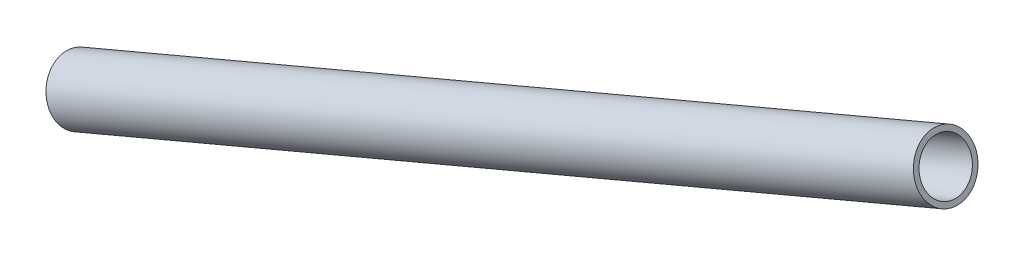
ISO-10303-21;
HEADER;
FILE_DESCRIPTION(('STEP AP214'),'2;1');
FILE_NAME('part.step','',(''),(''),'','','');
FILE_SCHEMA(('AUTOMOTIVE_DESIGN { 1 0 10303 214 1 1 1 1 }'));
ENDSEC;
DATA;
#1=APPLICATION_CONTEXT('core data for automotive mechanical design processes');
#2=APPLICATION_PROTOCOL_DEFINITION('international standard','automotive_design',2000,#1);
#3=PRODUCT_CONTEXT('',#1,'mechanical');
#4=PRODUCT('Part','Part','',(#3));
#5=PRODUCT_RELATED_PRODUCT_CATEGORY('part','',(#4));
#6=PRODUCT_DEFINITION_FORMATION('','',#4);
#7=PRODUCT_DEFINITION_CONTEXT('part definition',#1,'design');
#8=PRODUCT_DEFINITION('design','',#6,#7);
#9=PRODUCT_DEFINITION_SHAPE('','',#8);
#10=(LENGTH_UNIT() NAMED_UNIT(*) SI_UNIT(.MILLI.,.METRE.));
#11=(NAMED_UNIT(*) PLANE_ANGLE_UNIT() SI_UNIT($,.RADIAN.));
#12=(NAMED_UNIT(*) SI_UNIT($,.STERADIAN.) SOLID_ANGLE_UNIT());
#13=UNCERTAINTY_MEASURE_WITH_UNIT(LENGTH_MEASURE(1.E-05),#10,'distance_accuracy_value','');
#14=(GEOMETRIC_REPRESENTATION_CONTEXT(3) GLOBAL_UNCERTAINTY_ASSIGNED_CONTEXT((#13)) GLOBAL_UNIT_ASSIGNED_CONTEXT((#10,
#11,#12)) REPRESENTATION_CONTEXT('',''));
#15=CARTESIAN_POINT('',(0.,0.,0.));
#16=DIRECTION('',(0.,0.,1.));
#17=DIRECTION('',(1.,0.,0.));
#18=AXIS2_PLACEMENT_3D('',#15,#16,#17);
#19=CARTESIAN_POINT('',(-235.822758213006,-1441.5759678821,0.));
#20=DIRECTION('',(0.920960288808867,0.389656446677182,0.));
#21=DIRECTION('',(-0.389656446677182,0.920960288808867,0.));
#22=AXIS2_PLACEMENT_3D('',#19,#20,#21);
#23=CYLINDRICAL_SURFACE('',#22,7.87400000000032);
#24=CARTESIAN_POINT('',(-510.328896657027,-1557.71896318488,0.));
#25=DIRECTION('',(0.920960288808867,0.389656446677182,0.));
#26=DIRECTION('',(-0.389656446677182,0.920960288808867,0.));
#27=AXIS2_PLACEMENT_3D('',#24,#25,#26);
#28=CIRCLE('',#27,7.87400000000053);
#29=CARTESIAN_POINT('',(-513.397051518163,-1550.4673218708,0.));
#30=VERTEX_POINT('',#29);
#31=EDGE_CURVE('E46',#30,#30,#28,.T.);
#32=ORIENTED_EDGE('',*,*,#31,.F.);
#33=EDGE_LOOP('',(#32));
#34=FACE_BOUND('',#33,.T.);
#35=CARTESIAN_POINT('',(-235.822758213006,-1441.5759678821,0.));
#36=DIRECTION('',(0.920960288808867,0.389656446677182,0.));
#37=DIRECTION('',(-0.389656446677182,0.920960288808867,0.));
#38=AXIS2_PLACEMENT_3D('',#35,#36,#37);
#39=CIRCLE('',#38,7.87400000000011);
#40=CARTESIAN_POINT('',(-238.890913074142,-1434.32432656802,0.));
#41=VERTEX_POINT('',#40);
#42=EDGE_CURVE('E10',#41,#41,#39,.T.);
#43=ORIENTED_EDGE('',*,*,#42,.T.);
#44=EDGE_LOOP('',(#43));
#45=FACE_BOUND('',#44,.T.);
#46=ADVANCED_FACE('F32',(#34,#45),#23,.F.);
#47=CARTESIAN_POINT('',(-232.75460335187,-1448.82760919618,0.));
#48=DIRECTION('',(-0.920960288808867,-0.389656446677182,0.));
#49=DIRECTION('',(0.389656446677182,-0.920960288808867,0.));
#50=AXIS2_PLACEMENT_3D('',#47,#48,#49);
#51=PLANE('',#50);
#52=ORIENTED_EDGE('',*,*,#42,.F.);
#53=EDGE_LOOP('',(#52));
#54=FACE_BOUND('',#53,.T.);
#55=CARTESIAN_POINT('',(-235.822758213006,-1441.5759678821,0.));
#56=DIRECTION('',(0.920960288808867,0.389656446677182,0.));
#57=DIRECTION('',(-0.389656446677182,0.920960288808867,0.));
#58=AXIS2_PLACEMENT_3D('',#55,#56,#57);
#59=CIRCLE('',#58,9.5250000000001);
#60=CARTESIAN_POINT('',(-239.534235867607,-1432.8038211312,0.));
#61=VERTEX_POINT('',#60);
#62=EDGE_CURVE('E38',#61,#61,#59,.T.);
#63=ORIENTED_EDGE('',*,*,#62,.T.);
#64=EDGE_LOOP('',(#63));
#65=FACE_BOUND('',#64,.T.);
#66=ADVANCED_FACE('F55',(#54,#65),#51,.F.);
#67=CARTESIAN_POINT('',(-235.822758213006,-1441.5759678821,0.));
#68=DIRECTION('',(0.920960288808867,0.389656446677182,0.));
#69=DIRECTION('',(-0.389656446677182,0.920960288808867,0.));
#70=AXIS2_PLACEMENT_3D('',#67,#68,#69);
#71=CYLINDRICAL_SURFACE('',#70,9.52500000000022);
#72=ORIENTED_EDGE('',*,*,#62,.F.);
#73=EDGE_LOOP('',(#72));
#74=FACE_BOUND('',#73,.T.);
#75=CARTESIAN_POINT('',(-510.328896657026,-1557.71896318488,0.));
#76=DIRECTION('',(0.920960288808867,0.389656446677182,0.));
#77=DIRECTION('',(-0.389656446677182,0.920960288808867,0.));
#78=AXIS2_PLACEMENT_3D('',#75,#76,#77);
#79=CIRCLE('',#78,9.52500000000039);
#80=CARTESIAN_POINT('',(-514.040374311627,-1548.94681643397,0.));
#81=VERTEX_POINT('',#80);
#82=EDGE_CURVE('E42',#81,#81,#79,.T.);
#83=ORIENTED_EDGE('',*,*,#82,.T.);
#84=EDGE_LOOP('',(#83));
#85=FACE_BOUND('',#84,.T.);
#86=ADVANCED_FACE('F59',(#74,#85),#71,.T.);
#87=CARTESIAN_POINT('',(-506.617419002426,-1566.49110993578,0.));
#88=DIRECTION('',(0.920960288808867,0.389656446677182,0.));
#89=DIRECTION('',(-0.389656446677182,0.920960288808867,0.));
#90=AXIS2_PLACEMENT_3D('',#87,#88,#89);
#91=PLANE('',#90);
#92=ORIENTED_EDGE('',*,*,#82,.F.);
#93=EDGE_LOOP('',(#92));
#94=FACE_BOUND('',#93,.T.);
#95=ORIENTED_EDGE('',*,*,#31,.T.);
#96=EDGE_LOOP('',(#95));
#97=FACE_BOUND('',#96,.T.);
#98=ADVANCED_FACE('F52',(#94,#97),#91,.F.);
#99=CLOSED_SHELL('',(#46,#66,#86,#98));
#100=MANIFOLD_SOLID_BREP('B2',#99);
#101=ADVANCED_BREP_SHAPE_REPRESENTATION('',(#18,#100),#14);
#102=SHAPE_DEFINITION_REPRESENTATION(#9,#101);
ENDSEC;
END-ISO-10303-21;
